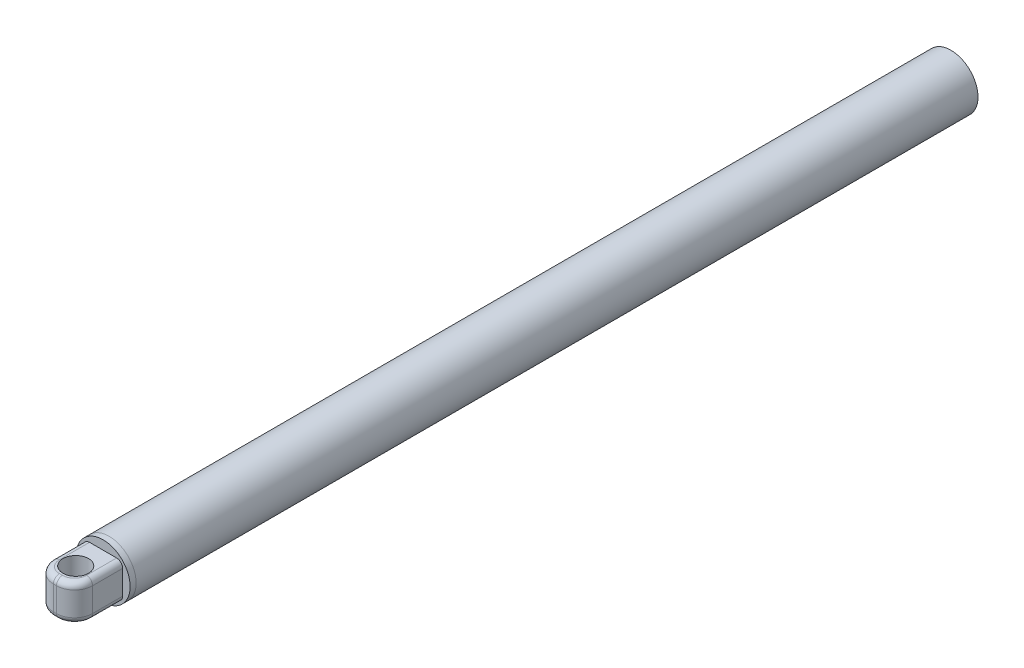
ISO-10303-21;
HEADER;
FILE_DESCRIPTION(('STEP AP214'),'2;1');
FILE_NAME('part.step','',(''),(''),'','','');
FILE_SCHEMA(('AUTOMOTIVE_DESIGN { 1 0 10303 214 1 1 1 1 }'));
ENDSEC;
DATA;
#1=APPLICATION_CONTEXT('core data for automotive mechanical design processes');
#2=APPLICATION_PROTOCOL_DEFINITION('international standard','automotive_design',2000,#1);
#3=PRODUCT_CONTEXT('',#1,'mechanical');
#4=PRODUCT('Part','Part','',(#3));
#5=PRODUCT_RELATED_PRODUCT_CATEGORY('part','',(#4));
#6=PRODUCT_DEFINITION_FORMATION('','',#4);
#7=PRODUCT_DEFINITION_CONTEXT('part definition',#1,'design');
#8=PRODUCT_DEFINITION('design','',#6,#7);
#9=PRODUCT_DEFINITION_SHAPE('','',#8);
#10=(LENGTH_UNIT() NAMED_UNIT(*) SI_UNIT(.MILLI.,.METRE.));
#11=(NAMED_UNIT(*) PLANE_ANGLE_UNIT() SI_UNIT($,.RADIAN.));
#12=(NAMED_UNIT(*) SI_UNIT($,.STERADIAN.) SOLID_ANGLE_UNIT());
#13=UNCERTAINTY_MEASURE_WITH_UNIT(LENGTH_MEASURE(1.E-05),#10,'distance_accuracy_value','');
#14=(GEOMETRIC_REPRESENTATION_CONTEXT(3) GLOBAL_UNCERTAINTY_ASSIGNED_CONTEXT((#13)) GLOBAL_UNIT_ASSIGNED_CONTEXT((#10,
#11,#12)) REPRESENTATION_CONTEXT('',''));
#15=CARTESIAN_POINT('',(0.,0.,0.));
#16=DIRECTION('',(0.,0.,1.));
#17=DIRECTION('',(1.,0.,0.));
#18=AXIS2_PLACEMENT_3D('',#15,#16,#17);
#19=CARTESIAN_POINT('',(0.,0.,141.));
#20=DIRECTION('',(0.,0.,-1.));
#21=DIRECTION('',(-1.,0.,0.));
#22=AXIS2_PLACEMENT_3D('',#19,#20,#21);
#23=CYLINDRICAL_SURFACE('',#22,4.5);
#24=CARTESIAN_POINT('',(0.,0.,141.));
#25=DIRECTION('',(0.,0.,1.));
#26=DIRECTION('',(1.,0.,0.));
#27=AXIS2_PLACEMENT_3D('',#24,#25,#26);
#28=CIRCLE('',#27,4.5);
#29=CARTESIAN_POINT('',(4.5,0.,141.));
#30=VERTEX_POINT('',#29);
#31=EDGE_CURVE('E177',#30,#30,#28,.T.);
#32=ORIENTED_EDGE('',*,*,#31,.F.);
#33=EDGE_LOOP('',(#32));
#34=FACE_BOUND('',#33,.T.);
#35=CARTESIAN_POINT('',(0.,0.,140.));
#36=DIRECTION('',(0.,0.,1.));
#37=DIRECTION('',(1.,0.,0.));
#38=AXIS2_PLACEMENT_3D('',#35,#36,#37);
#39=CIRCLE('',#38,4.5);
#40=CARTESIAN_POINT('',(4.5,0.,140.));
#41=VERTEX_POINT('',#40);
#42=EDGE_CURVE('E180',#41,#41,#39,.T.);
#43=ORIENTED_EDGE('',*,*,#42,.T.);
#44=EDGE_LOOP('',(#43));
#45=FACE_BOUND('',#44,.T.);
#46=ADVANCED_FACE('F40',(#34,#45),#23,.T.);
#47=CARTESIAN_POINT('',(0.,0.,141.));
#48=DIRECTION('',(0.,0.,1.));
#49=DIRECTION('',(1.,0.,0.));
#50=AXIS2_PLACEMENT_3D('',#47,#48,#49);
#51=PLANE('',#50);
#52=DIRECTION('',(0.,1.,0.));
#53=VECTOR('',#52,1.);
#54=CARTESIAN_POINT('',(3.25535178168934,-3.,141.));
#55=LINE('',#54,#53);
#56=CARTESIAN_POINT('',(3.25535178168934,-2.,141.));
#57=VERTEX_POINT('',#56);
#58=CARTESIAN_POINT('',(3.25535178168934,2.,141.));
#59=VERTEX_POINT('',#58);
#60=EDGE_CURVE('E262',#57,#59,#55,.T.);
#61=ORIENTED_EDGE('',*,*,#60,.F.);
#62=CARTESIAN_POINT('',(2.25535178168934,-2.,141.));
#63=DIRECTION('',(0.,0.,1.));
#64=DIRECTION('',(1.,0.,0.));
#65=AXIS2_PLACEMENT_3D('',#62,#63,#64);
#66=CIRCLE('',#65,1.);
#67=CARTESIAN_POINT('',(2.25535178168934,-3.,141.));
#68=VERTEX_POINT('',#67);
#69=EDGE_CURVE('E215',#57,#68,#66,.F.);
#70=ORIENTED_EDGE('',*,*,#69,.T.);
#71=DIRECTION('',(-1.,0.,0.));
#72=VECTOR('',#71,1.);
#73=CARTESIAN_POINT('',(-3.25535178168934,-3.,141.));
#74=LINE('',#73,#72);
#75=CARTESIAN_POINT('',(-2.25535178168934,-3.,141.));
#76=VERTEX_POINT('',#75);
#77=EDGE_CURVE('E168',#68,#76,#74,.T.);
#78=ORIENTED_EDGE('',*,*,#77,.T.);
#79=CARTESIAN_POINT('',(-2.25535178168934,-2.,141.));
#80=DIRECTION('',(0.,0.,1.));
#81=DIRECTION('',(1.,0.,0.));
#82=AXIS2_PLACEMENT_3D('',#79,#80,#81);
#83=CIRCLE('',#82,1.);
#84=CARTESIAN_POINT('',(-3.25535178168934,-2.,141.));
#85=VERTEX_POINT('',#84);
#86=EDGE_CURVE('E213',#76,#85,#83,.F.);
#87=ORIENTED_EDGE('',*,*,#86,.T.);
#88=DIRECTION('',(0.,1.,0.));
#89=VECTOR('',#88,1.);
#90=CARTESIAN_POINT('',(-3.25535178168934,-3.,141.));
#91=LINE('',#90,#89);
#92=CARTESIAN_POINT('',(-3.25535178168934,2.,141.));
#93=VERTEX_POINT('',#92);
#94=EDGE_CURVE('E161',#85,#93,#91,.T.);
#95=ORIENTED_EDGE('',*,*,#94,.T.);
#96=CARTESIAN_POINT('',(-2.25535178168934,2.,141.));
#97=DIRECTION('',(0.,0.,1.));
#98=DIRECTION('',(1.,0.,0.));
#99=AXIS2_PLACEMENT_3D('',#96,#97,#98);
#100=CIRCLE('',#99,1.);
#101=CARTESIAN_POINT('',(-2.25535178168934,3.,141.));
#102=VERTEX_POINT('',#101);
#103=EDGE_CURVE('E49',#93,#102,#100,.F.);
#104=ORIENTED_EDGE('',*,*,#103,.T.);
#105=DIRECTION('',(-1.,0.,0.));
#106=VECTOR('',#105,1.);
#107=CARTESIAN_POINT('',(-3.25535178168934,3.,141.));
#108=LINE('',#107,#106);
#109=CARTESIAN_POINT('',(2.25535178168934,3.,141.));
#110=VERTEX_POINT('',#109);
#111=EDGE_CURVE('E248',#110,#102,#108,.T.);
#112=ORIENTED_EDGE('',*,*,#111,.F.);
#113=CARTESIAN_POINT('',(2.25535178168934,2.,141.));
#114=DIRECTION('',(0.,0.,1.));
#115=DIRECTION('',(1.,0.,0.));
#116=AXIS2_PLACEMENT_3D('',#113,#114,#115);
#117=CIRCLE('',#116,1.);
#118=EDGE_CURVE('E12',#110,#59,#117,.F.);
#119=ORIENTED_EDGE('',*,*,#118,.T.);
#120=EDGE_LOOP('',(#61,#70,#78,#87,#95,#104,#112,#119));
#121=FACE_BOUND('',#120,.T.);
#122=ORIENTED_EDGE('',*,*,#31,.T.);
#123=EDGE_LOOP('',(#122));
#124=FACE_BOUND('',#123,.T.);
#125=ADVANCED_FACE('F251',(#121,#124),#51,.T.);
#126=CARTESIAN_POINT('',(0.,0.,140.));
#127=DIRECTION('',(0.,0.,1.));
#128=DIRECTION('',(1.,0.,0.));
#129=AXIS2_PLACEMENT_3D('',#126,#127,#128);
#130=PLANE('',#129);
#131=ORIENTED_EDGE('',*,*,#42,.F.);
#132=EDGE_LOOP('',(#131));
#133=FACE_BOUND('',#132,.T.);
#134=ADVANCED_FACE('F308',(#133),#130,.F.);
#135=CARTESIAN_POINT('',(-3.25535178168934,-3.,146.));
#136=DIRECTION('',(-1.,0.,0.));
#137=DIRECTION('',(0.,0.,1.));
#138=AXIS2_PLACEMENT_3D('',#135,#136,#137);
#139=PLANE('',#138);
#140=ORIENTED_EDGE('',*,*,#94,.F.);
#141=DIRECTION('',(0.,0.,1.));
#142=VECTOR('',#141,1.);
#143=CARTESIAN_POINT('',(-3.25535178168934,-2.,146.));
#144=LINE('',#143,#142);
#145=CARTESIAN_POINT('',(-3.25535178168934,-2.,146.));
#146=VERTEX_POINT('',#145);
#147=EDGE_CURVE('E138',#85,#146,#144,.T.);
#148=ORIENTED_EDGE('',*,*,#147,.T.);
#149=DIRECTION('',(0.,1.,0.));
#150=VECTOR('',#149,1.);
#151=CARTESIAN_POINT('',(-3.25535178168934,-3.,146.));
#152=LINE('',#151,#150);
#153=CARTESIAN_POINT('',(-3.25535178168934,2.,146.));
#154=VERTEX_POINT('',#153);
#155=EDGE_CURVE('E159',#146,#154,#152,.T.);
#156=ORIENTED_EDGE('',*,*,#155,.T.);
#157=DIRECTION('',(0.,0.,1.));
#158=VECTOR('',#157,1.);
#159=CARTESIAN_POINT('',(-3.25535178168934,2.,141.));
#160=LINE('',#159,#158);
#161=EDGE_CURVE('E163',#154,#93,#160,.F.);
#162=ORIENTED_EDGE('',*,*,#161,.T.);
#163=EDGE_LOOP('',(#140,#148,#156,#162));
#164=FACE_BOUND('',#163,.T.);
#165=ADVANCED_FACE('F158',(#164),#139,.T.);
#166=CARTESIAN_POINT('',(3.25535178168934,-3.,141.));
#167=DIRECTION('',(1.,0.,0.));
#168=DIRECTION('',(0.,0.,-1.));
#169=AXIS2_PLACEMENT_3D('',#166,#167,#168);
#170=PLANE('',#169);
#171=DIRECTION('',(0.,1.,0.));
#172=VECTOR('',#171,1.);
#173=CARTESIAN_POINT('',(3.25535178168934,-3.,146.));
#174=LINE('',#173,#172);
#175=CARTESIAN_POINT('',(3.25535178168934,-2.,146.));
#176=VERTEX_POINT('',#175);
#177=CARTESIAN_POINT('',(3.25535178168934,2.,146.));
#178=VERTEX_POINT('',#177);
#179=EDGE_CURVE('E264',#176,#178,#174,.T.);
#180=ORIENTED_EDGE('',*,*,#179,.F.);
#181=DIRECTION('',(0.,0.,-1.));
#182=VECTOR('',#181,1.);
#183=CARTESIAN_POINT('',(3.25535178168934,-2.,141.));
#184=LINE('',#183,#182);
#185=EDGE_CURVE('E198',#176,#57,#184,.T.);
#186=ORIENTED_EDGE('',*,*,#185,.T.);
#187=ORIENTED_EDGE('',*,*,#60,.T.);
#188=DIRECTION('',(0.,0.,-1.));
#189=VECTOR('',#188,1.);
#190=CARTESIAN_POINT('',(3.25535178168934,2.,146.));
#191=LINE('',#190,#189);
#192=EDGE_CURVE('E196',#59,#178,#191,.F.);
#193=ORIENTED_EDGE('',*,*,#192,.T.);
#194=EDGE_LOOP('',(#180,#186,#187,#193));
#195=FACE_BOUND('',#194,.T.);
#196=ADVANCED_FACE('F345',(#195),#170,.T.);
#197=CARTESIAN_POINT('',(0.255351781689342,-3.,146.));
#198=DIRECTION('',(0.,1.,0.));
#199=DIRECTION('',(0.,0.,1.));
#200=AXIS2_PLACEMENT_3D('',#197,#198,#199);
#201=CYLINDRICAL_SURFACE('',#200,3.);
#202=DIRECTION('',(0.,1.,0.));
#203=VECTOR('',#202,1.);
#204=CARTESIAN_POINT('',(0.255351781689343,-3.,149.));
#205=LINE('',#204,#203);
#206=CARTESIAN_POINT('',(0.255351781689343,-2.,149.));
#207=VERTEX_POINT('',#206);
#208=CARTESIAN_POINT('',(0.255351781689343,2.,149.));
#209=VERTEX_POINT('',#208);
#210=EDGE_CURVE('E170',#207,#209,#205,.T.);
#211=ORIENTED_EDGE('',*,*,#210,.F.);
#212=CARTESIAN_POINT('',(0.255351781689342,-2.,146.));
#213=DIRECTION('',(0.,-1.,0.));
#214=DIRECTION('',(0.,0.,-1.));
#215=AXIS2_PLACEMENT_3D('',#212,#213,#214);
#216=CIRCLE('',#215,3.);
#217=EDGE_CURVE('E211',#207,#176,#216,.F.);
#218=ORIENTED_EDGE('',*,*,#217,.T.);
#219=ORIENTED_EDGE('',*,*,#179,.T.);
#220=CARTESIAN_POINT('',(0.255351781689342,2.,146.));
#221=DIRECTION('',(0.,-1.,0.));
#222=DIRECTION('',(0.,0.,-1.));
#223=AXIS2_PLACEMENT_3D('',#220,#221,#222);
#224=CIRCLE('',#223,3.);
#225=EDGE_CURVE('E209',#178,#209,#224,.T.);
#226=ORIENTED_EDGE('',*,*,#225,.T.);
#227=EDGE_LOOP('',(#211,#218,#219,#226));
#228=FACE_BOUND('',#227,.T.);
#229=ADVANCED_FACE('F348',(#228),#201,.T.);
#230=CARTESIAN_POINT('',(0.255351781689342,-3.,149.));
#231=DIRECTION('',(0.,0.,1.));
#232=DIRECTION('',(1.,0.,0.));
#233=AXIS2_PLACEMENT_3D('',#230,#231,#232);
#234=PLANE('',#233);
#235=DIRECTION('',(0.,1.,0.));
#236=VECTOR('',#235,1.);
#237=CARTESIAN_POINT('',(-0.255351781689341,-3.,149.));
#238=LINE('',#237,#236);
#239=CARTESIAN_POINT('',(-0.255351781689341,-2.,149.));
#240=VERTEX_POINT('',#239);
#241=CARTESIAN_POINT('',(-0.255351781689341,2.,149.));
#242=VERTEX_POINT('',#241);
#243=EDGE_CURVE('E167',#240,#242,#238,.T.);
#244=ORIENTED_EDGE('',*,*,#243,.F.);
#245=DIRECTION('',(1.,0.,0.));
#246=VECTOR('',#245,1.);
#247=CARTESIAN_POINT('',(0.255351781689342,-2.,149.));
#248=LINE('',#247,#246);
#249=EDGE_CURVE('E194',#240,#207,#248,.T.);
#250=ORIENTED_EDGE('',*,*,#249,.T.);
#251=ORIENTED_EDGE('',*,*,#210,.T.);
#252=DIRECTION('',(1.,0.,0.));
#253=VECTOR('',#252,1.);
#254=CARTESIAN_POINT('',(-0.255351781689341,2.,149.));
#255=LINE('',#254,#253);
#256=EDGE_CURVE('E152',#209,#242,#255,.F.);
#257=ORIENTED_EDGE('',*,*,#256,.T.);
#258=EDGE_LOOP('',(#244,#250,#251,#257));
#259=FACE_BOUND('',#258,.T.);
#260=ADVANCED_FACE('F269',(#259),#234,.T.);
#261=CARTESIAN_POINT('',(-0.255351781689341,-3.,146.));
#262=DIRECTION('',(0.,1.,0.));
#263=DIRECTION('',(0.,0.,1.));
#264=AXIS2_PLACEMENT_3D('',#261,#262,#263);
#265=CYLINDRICAL_SURFACE('',#264,3.);
#266=ORIENTED_EDGE('',*,*,#155,.F.);
#267=CARTESIAN_POINT('',(-0.255351781689341,-2.,146.));
#268=DIRECTION('',(0.,-1.,0.));
#269=DIRECTION('',(0.,0.,-1.));
#270=AXIS2_PLACEMENT_3D('',#267,#268,#269);
#271=CIRCLE('',#270,3.);
#272=EDGE_CURVE('E145',#146,#240,#271,.F.);
#273=ORIENTED_EDGE('',*,*,#272,.T.);
#274=ORIENTED_EDGE('',*,*,#243,.T.);
#275=CARTESIAN_POINT('',(-0.255351781689341,2.,146.));
#276=DIRECTION('',(0.,-1.,0.));
#277=DIRECTION('',(0.,0.,-1.));
#278=AXIS2_PLACEMENT_3D('',#275,#276,#277);
#279=CIRCLE('',#278,3.);
#280=EDGE_CURVE('E153',#242,#154,#279,.T.);
#281=ORIENTED_EDGE('',*,*,#280,.T.);
#282=EDGE_LOOP('',(#266,#273,#274,#281));
#283=FACE_BOUND('',#282,.T.);
#284=ADVANCED_FACE('F165',(#283),#265,.T.);
#285=CARTESIAN_POINT('',(0.255351781689342,-3.,146.));
#286=DIRECTION('',(0.,-1.,0.));
#287=DIRECTION('',(0.,0.,-1.));
#288=AXIS2_PLACEMENT_3D('',#285,#286,#287);
#289=PLANE('',#288);
#290=CARTESIAN_POINT('',(0.,-3.,145.545007449977));
#291=DIRECTION('',(0.,1.,0.));
#292=DIRECTION('',(0.,0.,1.));
#293=AXIS2_PLACEMENT_3D('',#290,#291,#292);
#294=CIRCLE('',#293,2.125);
#295=CARTESIAN_POINT('',(0.,-3.,147.670007449977));
#296=VERTEX_POINT('',#295);
#297=EDGE_CURVE('E173',#296,#296,#294,.T.);
#298=ORIENTED_EDGE('',*,*,#297,.T.);
#299=EDGE_LOOP('',(#298));
#300=FACE_BOUND('',#299,.T.);
#301=CARTESIAN_POINT('',(-0.255351781689341,-3.,146.));
#302=DIRECTION('',(0.,-1.,0.));
#303=DIRECTION('',(0.,0.,-1.));
#304=AXIS2_PLACEMENT_3D('',#301,#302,#303);
#305=CIRCLE('',#304,2.);
#306=CARTESIAN_POINT('',(-0.255351781689341,-3.,148.));
#307=VERTEX_POINT('',#306);
#308=CARTESIAN_POINT('',(-2.25535178168934,-3.,146.));
#309=VERTEX_POINT('',#308);
#310=EDGE_CURVE('E189',#307,#309,#305,.T.);
#311=ORIENTED_EDGE('',*,*,#310,.T.);
#312=DIRECTION('',(0.,0.,1.));
#313=VECTOR('',#312,1.);
#314=CARTESIAN_POINT('',(-2.25535178168934,-3.,146.));
#315=LINE('',#314,#313);
#316=EDGE_CURVE('E139',#309,#76,#315,.F.);
#317=ORIENTED_EDGE('',*,*,#316,.T.);
#318=ORIENTED_EDGE('',*,*,#77,.F.);
#319=DIRECTION('',(0.,0.,-1.));
#320=VECTOR('',#319,1.);
#321=CARTESIAN_POINT('',(2.25535178168934,-3.,146.));
#322=LINE('',#321,#320);
#323=CARTESIAN_POINT('',(2.25535178168934,-3.,146.));
#324=VERTEX_POINT('',#323);
#325=EDGE_CURVE('E185',#68,#324,#322,.F.);
#326=ORIENTED_EDGE('',*,*,#325,.T.);
#327=CARTESIAN_POINT('',(0.255351781689342,-3.,146.));
#328=DIRECTION('',(0.,-1.,0.));
#329=DIRECTION('',(0.,0.,-1.));
#330=AXIS2_PLACEMENT_3D('',#327,#328,#329);
#331=CIRCLE('',#330,2.);
#332=CARTESIAN_POINT('',(0.255351781689343,-3.,148.));
#333=VERTEX_POINT('',#332);
#334=EDGE_CURVE('E162',#324,#333,#331,.T.);
#335=ORIENTED_EDGE('',*,*,#334,.T.);
#336=DIRECTION('',(1.,0.,0.));
#337=VECTOR('',#336,1.);
#338=CARTESIAN_POINT('',(0.255351781689342,-3.,148.));
#339=LINE('',#338,#337);
#340=EDGE_CURVE('E187',#333,#307,#339,.F.);
#341=ORIENTED_EDGE('',*,*,#340,.T.);
#342=EDGE_LOOP('',(#311,#317,#318,#326,#335,#341));
#343=FACE_BOUND('',#342,.T.);
#344=ADVANCED_FACE('F282',(#300,#343),#289,.T.);
#345=CARTESIAN_POINT('',(0.,-3.,145.545007449977));
#346=DIRECTION('',(0.,1.,0.));
#347=DIRECTION('',(0.,0.,1.));
#348=AXIS2_PLACEMENT_3D('',#345,#346,#347);
#349=CYLINDRICAL_SURFACE('',#348,2.125);
#350=ORIENTED_EDGE('',*,*,#297,.F.);
#351=EDGE_LOOP('',(#350));
#352=FACE_BOUND('',#351,.T.);
#353=CARTESIAN_POINT('',(0.,3.,145.545007449977));
#354=DIRECTION('',(0.,1.,0.));
#355=DIRECTION('',(0.,0.,1.));
#356=AXIS2_PLACEMENT_3D('',#353,#354,#355);
#357=CIRCLE('',#356,2.125);
#358=CARTESIAN_POINT('',(0.,3.,147.670007449977));
#359=VERTEX_POINT('',#358);
#360=EDGE_CURVE('E225',#359,#359,#357,.T.);
#361=ORIENTED_EDGE('',*,*,#360,.T.);
#362=EDGE_LOOP('',(#361));
#363=FACE_BOUND('',#362,.T.);
#364=ADVANCED_FACE('F334',(#352,#363),#349,.F.);
#365=CARTESIAN_POINT('',(0.255351781689342,3.,146.));
#366=DIRECTION('',(0.,-1.,0.));
#367=DIRECTION('',(0.,0.,-1.));
#368=AXIS2_PLACEMENT_3D('',#365,#366,#367);
#369=PLANE('',#368);
#370=ORIENTED_EDGE('',*,*,#111,.T.);
#371=DIRECTION('',(0.,0.,1.));
#372=VECTOR('',#371,1.);
#373=CARTESIAN_POINT('',(-2.25535178168934,3.,146.));
#374=LINE('',#373,#372);
#375=CARTESIAN_POINT('',(-2.25535178168934,3.,146.));
#376=VERTEX_POINT('',#375);
#377=EDGE_CURVE('E207',#102,#376,#374,.T.);
#378=ORIENTED_EDGE('',*,*,#377,.T.);
#379=CARTESIAN_POINT('',(-0.255351781689341,3.,146.));
#380=DIRECTION('',(0.,-1.,0.));
#381=DIRECTION('',(0.,0.,-1.));
#382=AXIS2_PLACEMENT_3D('',#379,#380,#381);
#383=CIRCLE('',#382,2.);
#384=CARTESIAN_POINT('',(-0.255351781689341,3.,148.));
#385=VERTEX_POINT('',#384);
#386=EDGE_CURVE('E64',#376,#385,#383,.F.);
#387=ORIENTED_EDGE('',*,*,#386,.T.);
#388=DIRECTION('',(1.,0.,0.));
#389=VECTOR('',#388,1.);
#390=CARTESIAN_POINT('',(0.255351781689343,3.,148.));
#391=LINE('',#390,#389);
#392=CARTESIAN_POINT('',(0.255351781689343,3.,148.));
#393=VERTEX_POINT('',#392);
#394=EDGE_CURVE('E204',#385,#393,#391,.T.);
#395=ORIENTED_EDGE('',*,*,#394,.T.);
#396=CARTESIAN_POINT('',(0.255351781689342,3.,146.));
#397=DIRECTION('',(0.,-1.,0.));
#398=DIRECTION('',(0.,0.,-1.));
#399=AXIS2_PLACEMENT_3D('',#396,#397,#398);
#400=CIRCLE('',#399,2.);
#401=CARTESIAN_POINT('',(2.25535178168934,3.,146.));
#402=VERTEX_POINT('',#401);
#403=EDGE_CURVE('E200',#393,#402,#400,.F.);
#404=ORIENTED_EDGE('',*,*,#403,.T.);
#405=DIRECTION('',(0.,0.,-1.));
#406=VECTOR('',#405,1.);
#407=CARTESIAN_POINT('',(2.25535178168934,3.,141.));
#408=LINE('',#407,#406);
#409=EDGE_CURVE('E202',#402,#110,#408,.T.);
#410=ORIENTED_EDGE('',*,*,#409,.T.);
#411=EDGE_LOOP('',(#370,#378,#387,#395,#404,#410));
#412=FACE_BOUND('',#411,.T.);
#413=ORIENTED_EDGE('',*,*,#360,.F.);
#414=EDGE_LOOP('',(#413));
#415=FACE_BOUND('',#414,.T.);
#416=ADVANCED_FACE('F246',(#412,#415),#369,.F.);
#417=CARTESIAN_POINT('',(2.25535178168934,-2.,141.));
#418=DIRECTION('',(0.,0.,-1.));
#419=DIRECTION('',(-1.,0.,0.));
#420=AXIS2_PLACEMENT_3D('',#417,#418,#419);
#421=CYLINDRICAL_SURFACE('',#420,1.);
#422=ORIENTED_EDGE('',*,*,#69,.F.);
#423=ORIENTED_EDGE('',*,*,#185,.F.);
#424=CARTESIAN_POINT('',(2.25535178168934,-2.,146.));
#425=DIRECTION('',(0.,0.,1.));
#426=DIRECTION('',(1.,0.,0.));
#427=AXIS2_PLACEMENT_3D('',#424,#425,#426);
#428=CIRCLE('',#427,1.);
#429=EDGE_CURVE('E222',#324,#176,#428,.T.);
#430=ORIENTED_EDGE('',*,*,#429,.F.);
#431=ORIENTED_EDGE('',*,*,#325,.F.);
#432=EDGE_LOOP('',(#422,#423,#430,#431));
#433=FACE_BOUND('',#432,.T.);
#434=ADVANCED_FACE('F285',(#433),#421,.T.);
#435=CARTESIAN_POINT('',(0.255351781689342,-2.,146.));
#436=DIRECTION('',(0.,-1.,0.));
#437=DIRECTION('',(0.,0.,-1.));
#438=AXIS2_PLACEMENT_3D('',#435,#436,#437);
#439=TOROIDAL_SURFACE('',#438,2.,1.);
#440=ORIENTED_EDGE('',*,*,#429,.T.);
#441=ORIENTED_EDGE('',*,*,#217,.F.);
#442=CARTESIAN_POINT('',(0.255351781689343,-2.,148.));
#443=DIRECTION('',(-1.,0.,0.));
#444=DIRECTION('',(0.,0.,1.));
#445=AXIS2_PLACEMENT_3D('',#442,#443,#444);
#446=CIRCLE('',#445,1.);
#447=EDGE_CURVE('E219',#333,#207,#446,.T.);
#448=ORIENTED_EDGE('',*,*,#447,.F.);
#449=ORIENTED_EDGE('',*,*,#334,.F.);
#450=EDGE_LOOP('',(#440,#441,#448,#449));
#451=FACE_BOUND('',#450,.T.);
#452=ADVANCED_FACE('F290',(#451),#439,.T.);
#453=CARTESIAN_POINT('',(0.255351781689342,-2.,148.));
#454=DIRECTION('',(1.,0.,0.));
#455=DIRECTION('',(0.,0.,-1.));
#456=AXIS2_PLACEMENT_3D('',#453,#454,#455);
#457=CYLINDRICAL_SURFACE('',#456,1.);
#458=ORIENTED_EDGE('',*,*,#447,.T.);
#459=ORIENTED_EDGE('',*,*,#249,.F.);
#460=CARTESIAN_POINT('',(-0.255351781689341,-2.,148.));
#461=DIRECTION('',(-1.,0.,0.));
#462=DIRECTION('',(0.,0.,1.));
#463=AXIS2_PLACEMENT_3D('',#460,#461,#462);
#464=CIRCLE('',#463,1.);
#465=EDGE_CURVE('E142',#307,#240,#464,.T.);
#466=ORIENTED_EDGE('',*,*,#465,.F.);
#467=ORIENTED_EDGE('',*,*,#340,.F.);
#468=EDGE_LOOP('',(#458,#459,#466,#467));
#469=FACE_BOUND('',#468,.T.);
#470=ADVANCED_FACE('F293',(#469),#457,.T.);
#471=CARTESIAN_POINT('',(-0.255351781689341,-2.,146.));
#472=DIRECTION('',(0.,-1.,0.));
#473=DIRECTION('',(0.,0.,-1.));
#474=AXIS2_PLACEMENT_3D('',#471,#472,#473);
#475=TOROIDAL_SURFACE('',#474,2.,1.);
#476=ORIENTED_EDGE('',*,*,#465,.T.);
#477=ORIENTED_EDGE('',*,*,#272,.F.);
#478=CARTESIAN_POINT('',(-2.25535178168934,-2.,146.));
#479=DIRECTION('',(0.,0.,-1.));
#480=DIRECTION('',(-1.,0.,0.));
#481=AXIS2_PLACEMENT_3D('',#478,#479,#480);
#482=CIRCLE('',#481,1.);
#483=EDGE_CURVE('E133',#309,#146,#482,.T.);
#484=ORIENTED_EDGE('',*,*,#483,.F.);
#485=ORIENTED_EDGE('',*,*,#310,.F.);
#486=EDGE_LOOP('',(#476,#477,#484,#485));
#487=FACE_BOUND('',#486,.T.);
#488=ADVANCED_FACE('F146',(#487),#475,.T.);
#489=CARTESIAN_POINT('',(-2.25535178168934,-2.,146.));
#490=DIRECTION('',(0.,0.,1.));
#491=DIRECTION('',(1.,0.,0.));
#492=AXIS2_PLACEMENT_3D('',#489,#490,#491);
#493=CYLINDRICAL_SURFACE('',#492,1.);
#494=ORIENTED_EDGE('',*,*,#86,.F.);
#495=ORIENTED_EDGE('',*,*,#316,.F.);
#496=ORIENTED_EDGE('',*,*,#483,.T.);
#497=ORIENTED_EDGE('',*,*,#147,.F.);
#498=EDGE_LOOP('',(#494,#495,#496,#497));
#499=FACE_BOUND('',#498,.T.);
#500=ADVANCED_FACE('F136',(#499),#493,.T.);
#501=CARTESIAN_POINT('',(2.25535178168934,2.,146.));
#502=DIRECTION('',(0.,0.,1.));
#503=DIRECTION('',(1.,0.,0.));
#504=AXIS2_PLACEMENT_3D('',#501,#502,#503);
#505=CYLINDRICAL_SURFACE('',#504,1.);
#506=ORIENTED_EDGE('',*,*,#118,.F.);
#507=ORIENTED_EDGE('',*,*,#409,.F.);
#508=CARTESIAN_POINT('',(2.25535178168934,2.,146.));
#509=DIRECTION('',(0.,0.,1.));
#510=DIRECTION('',(1.,0.,0.));
#511=AXIS2_PLACEMENT_3D('',#508,#509,#510);
#512=CIRCLE('',#511,1.);
#513=EDGE_CURVE('E44',#178,#402,#512,.T.);
#514=ORIENTED_EDGE('',*,*,#513,.F.);
#515=ORIENTED_EDGE('',*,*,#192,.F.);
#516=EDGE_LOOP('',(#506,#507,#514,#515));
#517=FACE_BOUND('',#516,.T.);
#518=ADVANCED_FACE('F42',(#517),#505,.T.);
#519=CARTESIAN_POINT('',(0.255351781689342,2.,146.));
#520=DIRECTION('',(0.,-1.,0.));
#521=DIRECTION('',(0.,0.,-1.));
#522=AXIS2_PLACEMENT_3D('',#519,#520,#521);
#523=TOROIDAL_SURFACE('',#522,2.,1.);
#524=ORIENTED_EDGE('',*,*,#513,.T.);
#525=ORIENTED_EDGE('',*,*,#403,.F.);
#526=CARTESIAN_POINT('',(0.255351781689342,2.,148.));
#527=DIRECTION('',(-1.,0.,0.));
#528=DIRECTION('',(0.,-1.,0.));
#529=AXIS2_PLACEMENT_3D('',#526,#527,#528);
#530=CIRCLE('',#529,1.);
#531=EDGE_CURVE('E229',#209,#393,#530,.T.);
#532=ORIENTED_EDGE('',*,*,#531,.F.);
#533=ORIENTED_EDGE('',*,*,#225,.F.);
#534=EDGE_LOOP('',(#524,#525,#532,#533));
#535=FACE_BOUND('',#534,.T.);
#536=ADVANCED_FACE('F239',(#535),#523,.T.);
#537=CARTESIAN_POINT('',(0.255351781689342,2.,148.));
#538=DIRECTION('',(-1.,0.,0.));
#539=DIRECTION('',(0.,0.,1.));
#540=AXIS2_PLACEMENT_3D('',#537,#538,#539);
#541=CYLINDRICAL_SURFACE('',#540,1.);
#542=ORIENTED_EDGE('',*,*,#531,.T.);
#543=ORIENTED_EDGE('',*,*,#394,.F.);
#544=CARTESIAN_POINT('',(-0.255351781689341,2.,148.));
#545=DIRECTION('',(-1.,0.,0.));
#546=DIRECTION('',(0.,0.,1.));
#547=AXIS2_PLACEMENT_3D('',#544,#545,#546);
#548=CIRCLE('',#547,1.);
#549=EDGE_CURVE('E227',#242,#385,#548,.T.);
#550=ORIENTED_EDGE('',*,*,#549,.F.);
#551=ORIENTED_EDGE('',*,*,#256,.F.);
#552=EDGE_LOOP('',(#542,#543,#550,#551));
#553=FACE_BOUND('',#552,.T.);
#554=ADVANCED_FACE('F274',(#553),#541,.T.);
#555=CARTESIAN_POINT('',(-0.255351781689341,2.,146.));
#556=DIRECTION('',(0.,-1.,0.));
#557=DIRECTION('',(0.,0.,-1.));
#558=AXIS2_PLACEMENT_3D('',#555,#556,#557);
#559=TOROIDAL_SURFACE('',#558,2.,1.);
#560=ORIENTED_EDGE('',*,*,#549,.T.);
#561=ORIENTED_EDGE('',*,*,#386,.F.);
#562=CARTESIAN_POINT('',(-2.25535178168934,2.,146.));
#563=DIRECTION('',(0.,0.,-1.));
#564=DIRECTION('',(-1.,0.,0.));
#565=AXIS2_PLACEMENT_3D('',#562,#563,#564);
#566=CIRCLE('',#565,1.);
#567=EDGE_CURVE('E57',#154,#376,#566,.T.);
#568=ORIENTED_EDGE('',*,*,#567,.F.);
#569=ORIENTED_EDGE('',*,*,#280,.F.);
#570=EDGE_LOOP('',(#560,#561,#568,#569));
#571=FACE_BOUND('',#570,.T.);
#572=ADVANCED_FACE('F276',(#571),#559,.T.);
#573=CARTESIAN_POINT('',(-2.25535178168934,2.,146.));
#574=DIRECTION('',(0.,0.,-1.));
#575=DIRECTION('',(-1.,0.,0.));
#576=AXIS2_PLACEMENT_3D('',#573,#574,#575);
#577=CYLINDRICAL_SURFACE('',#576,1.);
#578=ORIENTED_EDGE('',*,*,#103,.F.);
#579=ORIENTED_EDGE('',*,*,#161,.F.);
#580=ORIENTED_EDGE('',*,*,#567,.T.);
#581=ORIENTED_EDGE('',*,*,#377,.F.);
#582=EDGE_LOOP('',(#578,#579,#580,#581));
#583=FACE_BOUND('',#582,.T.);
#584=ADVANCED_FACE('F277',(#583),#577,.T.);
#585=CLOSED_SHELL('',(#46,#125,#134,#165,#196,#229,#260,#284,#344,#364,#416,#434,#452,#470,#488,
#500,#518,#536,#554,#572,#584));
#586=MANIFOLD_SOLID_BREP('B2',#585);
#587=CARTESIAN_POINT('',(0.,0.,140.));
#588=DIRECTION('',(0.,0.,-1.));
#589=DIRECTION('',(-1.,0.,0.));
#590=AXIS2_PLACEMENT_3D('',#587,#588,#589);
#591=CYLINDRICAL_SURFACE('',#590,4.5);
#592=CARTESIAN_POINT('',(0.,0.,140.));
#593=DIRECTION('',(0.,0.,1.));
#594=DIRECTION('',(1.,0.,0.));
#595=AXIS2_PLACEMENT_3D('',#592,#593,#594);
#596=CIRCLE('',#595,4.5);
#597=CARTESIAN_POINT('',(4.5,0.,140.));
#598=VERTEX_POINT('',#597);
#599=EDGE_CURVE('E39',#598,#598,#596,.T.);
#600=ORIENTED_EDGE('',*,*,#599,.F.);
#601=EDGE_LOOP('',(#600));
#602=FACE_BOUND('',#601,.T.);
#603=CARTESIAN_POINT('',(0.,0.,0.));
#604=DIRECTION('',(0.,0.,1.));
#605=DIRECTION('',(1.,0.,0.));
#606=AXIS2_PLACEMENT_3D('',#603,#604,#605);
#607=CIRCLE('',#606,4.5);
#608=CARTESIAN_POINT('',(4.5,0.,0.));
#609=VERTEX_POINT('',#608);
#610=EDGE_CURVE('E481',#609,#609,#607,.T.);
#611=ORIENTED_EDGE('',*,*,#610,.T.);
#612=EDGE_LOOP('',(#611));
#613=FACE_BOUND('',#612,.T.);
#614=ADVANCED_FACE('F478',(#602,#613),#591,.T.);
#615=CARTESIAN_POINT('',(0.,0.,140.));
#616=DIRECTION('',(0.,0.,1.));
#617=DIRECTION('',(1.,0.,0.));
#618=AXIS2_PLACEMENT_3D('',#615,#616,#617);
#619=PLANE('',#618);
#620=ORIENTED_EDGE('',*,*,#599,.T.);
#621=EDGE_LOOP('',(#620));
#622=FACE_BOUND('',#621,.T.);
#623=ADVANCED_FACE('F493',(#622),#619,.T.);
#624=CARTESIAN_POINT('',(0.,0.,0.));
#625=DIRECTION('',(0.,0.,1.));
#626=DIRECTION('',(1.,0.,0.));
#627=AXIS2_PLACEMENT_3D('',#624,#625,#626);
#628=PLANE('',#627);
#629=ORIENTED_EDGE('',*,*,#610,.F.);
#630=EDGE_LOOP('',(#629));
#631=FACE_BOUND('',#630,.T.);
#632=ADVANCED_FACE('F491',(#631),#628,.F.);
#633=CLOSED_SHELL('',(#614,#623,#632));
#634=MANIFOLD_SOLID_BREP('B6',#633);
#635=ADVANCED_BREP_SHAPE_REPRESENTATION('',(#18,#586,#634),#14);
#636=SHAPE_DEFINITION_REPRESENTATION(#9,#635);
ENDSEC;
END-ISO-10303-21;
